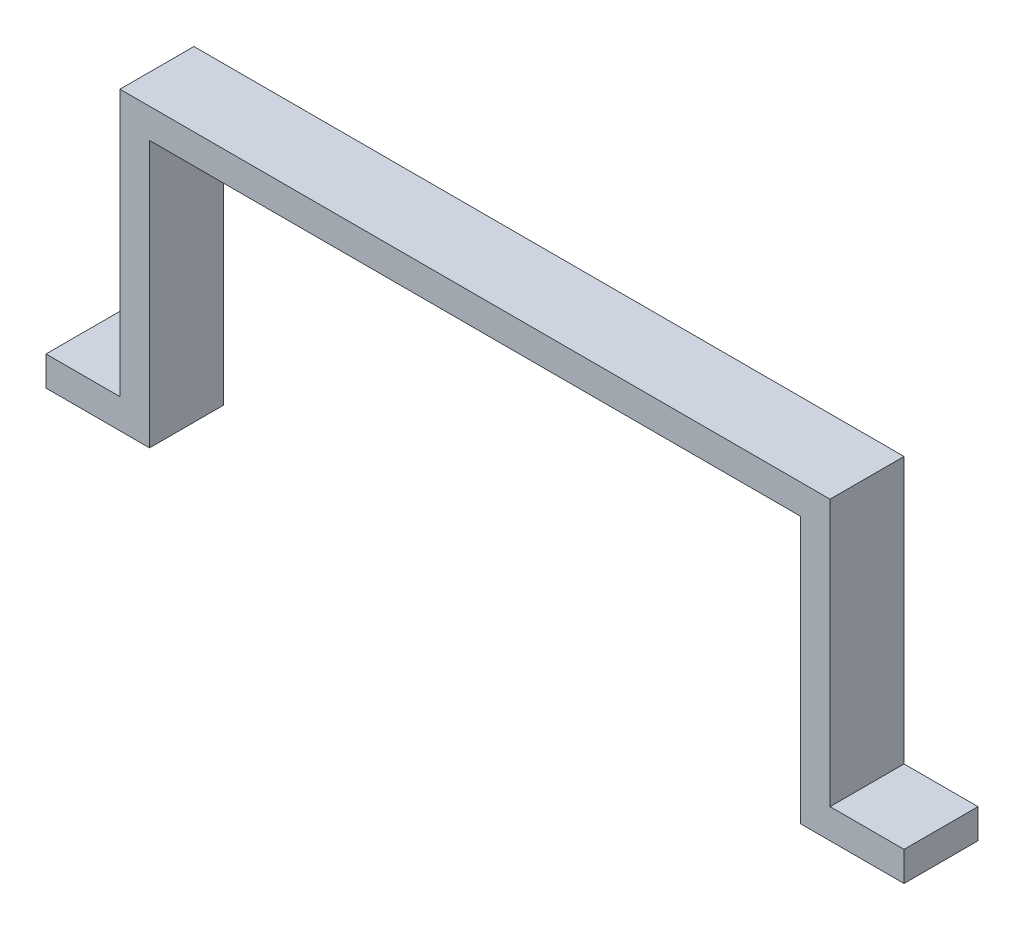
ISO-10303-21;
HEADER;
FILE_DESCRIPTION(('STEP AP214'),'2;1');
FILE_NAME('part.step','',(''),(''),'','','');
FILE_SCHEMA(('AUTOMOTIVE_DESIGN { 1 0 10303 214 1 1 1 1 }'));
ENDSEC;
DATA;
#1=APPLICATION_CONTEXT('core data for automotive mechanical design processes');
#2=APPLICATION_PROTOCOL_DEFINITION('international standard','automotive_design',2000,#1);
#3=PRODUCT_CONTEXT('',#1,'mechanical');
#4=PRODUCT('Part','Part','',(#3));
#5=PRODUCT_RELATED_PRODUCT_CATEGORY('part','',(#4));
#6=PRODUCT_DEFINITION_FORMATION('','',#4);
#7=PRODUCT_DEFINITION_CONTEXT('part definition',#1,'design');
#8=PRODUCT_DEFINITION('design','',#6,#7);
#9=PRODUCT_DEFINITION_SHAPE('','',#8);
#10=(LENGTH_UNIT() NAMED_UNIT(*) SI_UNIT(.MILLI.,.METRE.));
#11=(NAMED_UNIT(*) PLANE_ANGLE_UNIT() SI_UNIT($,.RADIAN.));
#12=(NAMED_UNIT(*) SI_UNIT($,.STERADIAN.) SOLID_ANGLE_UNIT());
#13=UNCERTAINTY_MEASURE_WITH_UNIT(LENGTH_MEASURE(1.E-05),#10,'distance_accuracy_value','');
#14=(GEOMETRIC_REPRESENTATION_CONTEXT(3) GLOBAL_UNCERTAINTY_ASSIGNED_CONTEXT((#13)) GLOBAL_UNIT_ASSIGNED_CONTEXT((#10,
#11,#12)) REPRESENTATION_CONTEXT('',''));
#15=CARTESIAN_POINT('',(0.,0.,0.));
#16=DIRECTION('',(0.,0.,1.));
#17=DIRECTION('',(1.,0.,0.));
#18=AXIS2_PLACEMENT_3D('',#15,#16,#17);
#19=CARTESIAN_POINT('',(-240.,20.,50.));
#20=DIRECTION('',(0.,-1.,0.));
#21=DIRECTION('',(1.,0.,0.));
#22=AXIS2_PLACEMENT_3D('',#19,#20,#21);
#23=PLANE('',#22);
#24=DIRECTION('',(-1.,0.,0.));
#25=VECTOR('',#24,1.);
#26=CARTESIAN_POINT('',(-240.,20.,0.));
#27=LINE('',#26,#25);
#28=CARTESIAN_POINT('',(-240.,20.,0.));
#29=VERTEX_POINT('',#28);
#30=CARTESIAN_POINT('',(-290.,20.,0.));
#31=VERTEX_POINT('',#30);
#32=EDGE_CURVE('E155',#29,#31,#27,.T.);
#33=ORIENTED_EDGE('',*,*,#32,.T.);
#34=DIRECTION('',(0.,0.,-1.));
#35=VECTOR('',#34,1.);
#36=CARTESIAN_POINT('',(-290.,20.,50.));
#37=LINE('',#36,#35);
#38=CARTESIAN_POINT('',(-290.,20.,50.));
#39=VERTEX_POINT('',#38);
#40=EDGE_CURVE('E40',#39,#31,#37,.T.);
#41=ORIENTED_EDGE('',*,*,#40,.F.);
#42=DIRECTION('',(-1.,0.,0.));
#43=VECTOR('',#42,1.);
#44=CARTESIAN_POINT('',(-240.,20.,50.));
#45=LINE('',#44,#43);
#46=CARTESIAN_POINT('',(-240.,20.,50.));
#47=VERTEX_POINT('',#46);
#48=EDGE_CURVE('E101',#47,#39,#45,.T.);
#49=ORIENTED_EDGE('',*,*,#48,.F.);
#50=DIRECTION('',(0.,0.,-1.));
#51=VECTOR('',#50,1.);
#52=CARTESIAN_POINT('',(-240.,20.,50.));
#53=LINE('',#52,#51);
#54=EDGE_CURVE('E11',#47,#29,#53,.T.);
#55=ORIENTED_EDGE('',*,*,#54,.T.);
#56=EDGE_LOOP('',(#33,#41,#49,#55));
#57=FACE_BOUND('',#56,.T.);
#58=ADVANCED_FACE('F32',(#57),#23,.F.);
#59=CARTESIAN_POINT('',(-290.,20.,50.));
#60=DIRECTION('',(1.,0.,0.));
#61=DIRECTION('',(0.,0.,-1.));
#62=AXIS2_PLACEMENT_3D('',#59,#60,#61);
#63=PLANE('',#62);
#64=DIRECTION('',(0.,-1.,0.));
#65=VECTOR('',#64,1.);
#66=CARTESIAN_POINT('',(-290.,20.,0.));
#67=LINE('',#66,#65);
#68=CARTESIAN_POINT('',(-290.,0.,0.));
#69=VERTEX_POINT('',#68);
#70=EDGE_CURVE('E157',#31,#69,#67,.T.);
#71=ORIENTED_EDGE('',*,*,#70,.T.);
#72=DIRECTION('',(0.,0.,-1.));
#73=VECTOR('',#72,1.);
#74=CARTESIAN_POINT('',(-290.,0.,50.));
#75=LINE('',#74,#73);
#76=CARTESIAN_POINT('',(-290.,0.,50.));
#77=VERTEX_POINT('',#76);
#78=EDGE_CURVE('E198',#77,#69,#75,.T.);
#79=ORIENTED_EDGE('',*,*,#78,.F.);
#80=DIRECTION('',(0.,-1.,0.));
#81=VECTOR('',#80,1.);
#82=CARTESIAN_POINT('',(-290.,20.,50.));
#83=LINE('',#82,#81);
#84=EDGE_CURVE('E206',#39,#77,#83,.T.);
#85=ORIENTED_EDGE('',*,*,#84,.F.);
#86=ORIENTED_EDGE('',*,*,#40,.T.);
#87=EDGE_LOOP('',(#71,#79,#85,#86));
#88=FACE_BOUND('',#87,.T.);
#89=ADVANCED_FACE('F204',(#88),#63,.F.);
#90=CARTESIAN_POINT('',(-290.,0.,50.));
#91=DIRECTION('',(0.,1.,0.));
#92=DIRECTION('',(-1.,0.,0.));
#93=AXIS2_PLACEMENT_3D('',#90,#91,#92);
#94=PLANE('',#93);
#95=DIRECTION('',(1.,0.,0.));
#96=VECTOR('',#95,1.);
#97=CARTESIAN_POINT('',(-290.,0.,0.));
#98=LINE('',#97,#96);
#99=CARTESIAN_POINT('',(-220.,0.,0.));
#100=VERTEX_POINT('',#99);
#101=EDGE_CURVE('E159',#69,#100,#98,.T.);
#102=ORIENTED_EDGE('',*,*,#101,.T.);
#103=DIRECTION('',(0.,0.,-1.));
#104=VECTOR('',#103,1.);
#105=CARTESIAN_POINT('',(-220.,0.,50.));
#106=LINE('',#105,#104);
#107=CARTESIAN_POINT('',(-220.,0.,50.));
#108=VERTEX_POINT('',#107);
#109=EDGE_CURVE('E195',#108,#100,#106,.T.);
#110=ORIENTED_EDGE('',*,*,#109,.F.);
#111=DIRECTION('',(1.,0.,0.));
#112=VECTOR('',#111,1.);
#113=CARTESIAN_POINT('',(-290.,0.,50.));
#114=LINE('',#113,#112);
#115=EDGE_CURVE('E218',#77,#108,#114,.T.);
#116=ORIENTED_EDGE('',*,*,#115,.F.);
#117=ORIENTED_EDGE('',*,*,#78,.T.);
#118=EDGE_LOOP('',(#102,#110,#116,#117));
#119=FACE_BOUND('',#118,.T.);
#120=ADVANCED_FACE('F215',(#119),#94,.F.);
#121=CARTESIAN_POINT('',(-220.,20.,50.));
#122=DIRECTION('',(-1.,0.,0.));
#123=DIRECTION('',(0.,0.,1.));
#124=AXIS2_PLACEMENT_3D('',#121,#122,#123);
#125=PLANE('',#124);
#126=DIRECTION('',(0.,1.,0.));
#127=VECTOR('',#126,1.);
#128=CARTESIAN_POINT('',(-220.,20.,0.));
#129=LINE('',#128,#127);
#130=CARTESIAN_POINT('',(-220.,180.,0.));
#131=VERTEX_POINT('',#130);
#132=EDGE_CURVE('E162',#100,#131,#129,.T.);
#133=ORIENTED_EDGE('',*,*,#132,.T.);
#134=DIRECTION('',(0.,0.,-1.));
#135=VECTOR('',#134,1.);
#136=CARTESIAN_POINT('',(-220.,180.,50.));
#137=LINE('',#136,#135);
#138=CARTESIAN_POINT('',(-220.,180.,50.));
#139=VERTEX_POINT('',#138);
#140=EDGE_CURVE('E192',#139,#131,#137,.T.);
#141=ORIENTED_EDGE('',*,*,#140,.F.);
#142=DIRECTION('',(0.,-1.,0.));
#143=VECTOR('',#142,1.);
#144=CARTESIAN_POINT('',(-220.,20.,50.));
#145=LINE('',#144,#143);
#146=EDGE_CURVE('E219',#139,#108,#145,.T.);
#147=ORIENTED_EDGE('',*,*,#146,.T.);
#148=ORIENTED_EDGE('',*,*,#109,.T.);
#149=EDGE_LOOP('',(#133,#141,#147,#148));
#150=FACE_BOUND('',#149,.T.);
#151=ADVANCED_FACE('F254',(#150),#125,.F.);
#152=CARTESIAN_POINT('',(-220.,180.,50.));
#153=DIRECTION('',(0.,1.,0.));
#154=DIRECTION('',(0.,0.,1.));
#155=AXIS2_PLACEMENT_3D('',#152,#153,#154);
#156=PLANE('',#155);
#157=DIRECTION('',(1.,0.,0.));
#158=VECTOR('',#157,1.);
#159=CARTESIAN_POINT('',(-220.,180.,0.));
#160=LINE('',#159,#158);
#161=CARTESIAN_POINT('',(220.,180.,0.));
#162=VERTEX_POINT('',#161);
#163=EDGE_CURVE('E164',#131,#162,#160,.T.);
#164=ORIENTED_EDGE('',*,*,#163,.T.);
#165=DIRECTION('',(0.,0.,-1.));
#166=VECTOR('',#165,1.);
#167=CARTESIAN_POINT('',(220.,180.,50.));
#168=LINE('',#167,#166);
#169=CARTESIAN_POINT('',(220.,180.,50.));
#170=VERTEX_POINT('',#169);
#171=EDGE_CURVE('E189',#170,#162,#168,.T.);
#172=ORIENTED_EDGE('',*,*,#171,.F.);
#173=DIRECTION('',(1.,0.,0.));
#174=VECTOR('',#173,1.);
#175=CARTESIAN_POINT('',(-220.,180.,50.));
#176=LINE('',#175,#174);
#177=EDGE_CURVE('E221',#139,#170,#176,.T.);
#178=ORIENTED_EDGE('',*,*,#177,.F.);
#179=ORIENTED_EDGE('',*,*,#140,.T.);
#180=EDGE_LOOP('',(#164,#172,#178,#179));
#181=FACE_BOUND('',#180,.T.);
#182=ADVANCED_FACE('F259',(#181),#156,.F.);
#183=CARTESIAN_POINT('',(220.,20.,50.));
#184=DIRECTION('',(1.,0.,0.));
#185=DIRECTION('',(0.,0.,-1.));
#186=AXIS2_PLACEMENT_3D('',#183,#184,#185);
#187=PLANE('',#186);
#188=DIRECTION('',(0.,-1.,0.));
#189=VECTOR('',#188,1.);
#190=CARTESIAN_POINT('',(220.,20.,0.));
#191=LINE('',#190,#189);
#192=CARTESIAN_POINT('',(220.,0.,0.));
#193=VERTEX_POINT('',#192);
#194=EDGE_CURVE('E167',#162,#193,#191,.T.);
#195=ORIENTED_EDGE('',*,*,#194,.T.);
#196=DIRECTION('',(0.,0.,-1.));
#197=VECTOR('',#196,1.);
#198=CARTESIAN_POINT('',(220.,0.,50.));
#199=LINE('',#198,#197);
#200=CARTESIAN_POINT('',(220.,0.,50.));
#201=VERTEX_POINT('',#200);
#202=EDGE_CURVE('E187',#201,#193,#199,.T.);
#203=ORIENTED_EDGE('',*,*,#202,.F.);
#204=DIRECTION('',(0.,1.,0.));
#205=VECTOR('',#204,1.);
#206=CARTESIAN_POINT('',(220.,20.,50.));
#207=LINE('',#206,#205);
#208=EDGE_CURVE('E227',#201,#170,#207,.T.);
#209=ORIENTED_EDGE('',*,*,#208,.T.);
#210=ORIENTED_EDGE('',*,*,#171,.T.);
#211=EDGE_LOOP('',(#195,#203,#209,#210));
#212=FACE_BOUND('',#211,.T.);
#213=ADVANCED_FACE('F263',(#212),#187,.F.);
#214=CARTESIAN_POINT('',(290.,0.,50.));
#215=DIRECTION('',(0.,-1.,0.));
#216=DIRECTION('',(1.,0.,0.));
#217=AXIS2_PLACEMENT_3D('',#214,#215,#216);
#218=PLANE('',#217);
#219=DIRECTION('',(-1.,0.,0.));
#220=VECTOR('',#219,1.);
#221=CARTESIAN_POINT('',(290.,0.,0.));
#222=LINE('',#221,#220);
#223=CARTESIAN_POINT('',(290.,0.,0.));
#224=VERTEX_POINT('',#223);
#225=EDGE_CURVE('E170',#224,#193,#222,.T.);
#226=ORIENTED_EDGE('',*,*,#225,.F.);
#227=DIRECTION('',(0.,0.,-1.));
#228=VECTOR('',#227,1.);
#229=CARTESIAN_POINT('',(290.,0.,50.));
#230=LINE('',#229,#228);
#231=CARTESIAN_POINT('',(290.,0.,50.));
#232=VERTEX_POINT('',#231);
#233=EDGE_CURVE('E185',#232,#224,#230,.T.);
#234=ORIENTED_EDGE('',*,*,#233,.F.);
#235=DIRECTION('',(-1.,0.,0.));
#236=VECTOR('',#235,1.);
#237=CARTESIAN_POINT('',(290.,0.,50.));
#238=LINE('',#237,#236);
#239=EDGE_CURVE('E230',#232,#201,#238,.T.);
#240=ORIENTED_EDGE('',*,*,#239,.T.);
#241=ORIENTED_EDGE('',*,*,#202,.T.);
#242=EDGE_LOOP('',(#226,#234,#240,#241));
#243=FACE_BOUND('',#242,.T.);
#244=ADVANCED_FACE('F267',(#243),#218,.T.);
#245=CARTESIAN_POINT('',(290.,20.,50.));
#246=DIRECTION('',(1.,0.,0.));
#247=DIRECTION('',(0.,0.,-1.));
#248=AXIS2_PLACEMENT_3D('',#245,#246,#247);
#249=PLANE('',#248);
#250=DIRECTION('',(0.,-1.,0.));
#251=VECTOR('',#250,1.);
#252=CARTESIAN_POINT('',(290.,20.,0.));
#253=LINE('',#252,#251);
#254=CARTESIAN_POINT('',(290.,20.,0.));
#255=VERTEX_POINT('',#254);
#256=EDGE_CURVE('E173',#255,#224,#253,.T.);
#257=ORIENTED_EDGE('',*,*,#256,.F.);
#258=DIRECTION('',(0.,0.,-1.));
#259=VECTOR('',#258,1.);
#260=CARTESIAN_POINT('',(290.,20.,50.));
#261=LINE('',#260,#259);
#262=CARTESIAN_POINT('',(290.,20.,50.));
#263=VERTEX_POINT('',#262);
#264=EDGE_CURVE('E138',#263,#255,#261,.T.);
#265=ORIENTED_EDGE('',*,*,#264,.F.);
#266=DIRECTION('',(0.,-1.,0.));
#267=VECTOR('',#266,1.);
#268=CARTESIAN_POINT('',(290.,20.,50.));
#269=LINE('',#268,#267);
#270=EDGE_CURVE('E146',#263,#232,#269,.T.);
#271=ORIENTED_EDGE('',*,*,#270,.T.);
#272=ORIENTED_EDGE('',*,*,#233,.T.);
#273=EDGE_LOOP('',(#257,#265,#271,#272));
#274=FACE_BOUND('',#273,.T.);
#275=ADVANCED_FACE('F234',(#274),#249,.T.);
#276=CARTESIAN_POINT('',(240.,20.,50.));
#277=DIRECTION('',(0.,1.,0.));
#278=DIRECTION('',(-1.,0.,0.));
#279=AXIS2_PLACEMENT_3D('',#276,#277,#278);
#280=PLANE('',#279);
#281=DIRECTION('',(1.,0.,0.));
#282=VECTOR('',#281,1.);
#283=CARTESIAN_POINT('',(240.,20.,0.));
#284=LINE('',#283,#282);
#285=CARTESIAN_POINT('',(240.,20.,0.));
#286=VERTEX_POINT('',#285);
#287=EDGE_CURVE('E134',#286,#255,#284,.T.);
#288=ORIENTED_EDGE('',*,*,#287,.F.);
#289=DIRECTION('',(0.,0.,-1.));
#290=VECTOR('',#289,1.);
#291=CARTESIAN_POINT('',(240.,20.,50.));
#292=LINE('',#291,#290);
#293=CARTESIAN_POINT('',(240.,20.,50.));
#294=VERTEX_POINT('',#293);
#295=EDGE_CURVE('E129',#294,#286,#292,.T.);
#296=ORIENTED_EDGE('',*,*,#295,.F.);
#297=DIRECTION('',(1.,0.,0.));
#298=VECTOR('',#297,1.);
#299=CARTESIAN_POINT('',(240.,20.,50.));
#300=LINE('',#299,#298);
#301=EDGE_CURVE('E132',#294,#263,#300,.T.);
#302=ORIENTED_EDGE('',*,*,#301,.T.);
#303=ORIENTED_EDGE('',*,*,#264,.T.);
#304=EDGE_LOOP('',(#288,#296,#302,#303));
#305=FACE_BOUND('',#304,.T.);
#306=ADVANCED_FACE('F131',(#305),#280,.T.);
#307=CARTESIAN_POINT('',(240.,200.,50.));
#308=DIRECTION('',(1.,0.,0.));
#309=DIRECTION('',(0.,1.,0.));
#310=AXIS2_PLACEMENT_3D('',#307,#308,#309);
#311=PLANE('',#310);
#312=DIRECTION('',(0.,-1.,0.));
#313=VECTOR('',#312,1.);
#314=CARTESIAN_POINT('',(240.,200.,0.));
#315=LINE('',#314,#313);
#316=CARTESIAN_POINT('',(240.,200.,0.));
#317=VERTEX_POINT('',#316);
#318=EDGE_CURVE('E177',#317,#286,#315,.T.);
#319=ORIENTED_EDGE('',*,*,#318,.F.);
#320=DIRECTION('',(0.,0.,-1.));
#321=VECTOR('',#320,1.);
#322=CARTESIAN_POINT('',(240.,200.,50.));
#323=LINE('',#322,#321);
#324=CARTESIAN_POINT('',(240.,200.,50.));
#325=VERTEX_POINT('',#324);
#326=EDGE_CURVE('E90',#325,#317,#323,.T.);
#327=ORIENTED_EDGE('',*,*,#326,.F.);
#328=DIRECTION('',(0.,-1.,0.));
#329=VECTOR('',#328,1.);
#330=CARTESIAN_POINT('',(240.,140.360024578222,50.));
#331=LINE('',#330,#329);
#332=EDGE_CURVE('E143',#325,#294,#331,.T.);
#333=ORIENTED_EDGE('',*,*,#332,.T.);
#334=ORIENTED_EDGE('',*,*,#295,.T.);
#335=EDGE_LOOP('',(#319,#327,#333,#334));
#336=FACE_BOUND('',#335,.T.);
#337=ADVANCED_FACE('F148',(#336),#311,.T.);
#338=CARTESIAN_POINT('',(240.,200.,50.));
#339=DIRECTION('',(0.,-1.,0.));
#340=DIRECTION('',(0.,0.,-1.));
#341=AXIS2_PLACEMENT_3D('',#338,#339,#340);
#342=PLANE('',#341);
#343=DIRECTION('',(-1.,0.,0.));
#344=VECTOR('',#343,1.);
#345=CARTESIAN_POINT('',(240.,200.,0.));
#346=LINE('',#345,#344);
#347=CARTESIAN_POINT('',(-240.,200.,0.));
#348=VERTEX_POINT('',#347);
#349=EDGE_CURVE('E94',#317,#348,#346,.T.);
#350=ORIENTED_EDGE('',*,*,#349,.T.);
#351=DIRECTION('',(0.,0.,-1.));
#352=VECTOR('',#351,1.);
#353=CARTESIAN_POINT('',(-240.,200.,50.));
#354=LINE('',#353,#352);
#355=CARTESIAN_POINT('',(-240.,200.,50.));
#356=VERTEX_POINT('',#355);
#357=EDGE_CURVE('E151',#356,#348,#354,.T.);
#358=ORIENTED_EDGE('',*,*,#357,.F.);
#359=DIRECTION('',(-1.,0.,0.));
#360=VECTOR('',#359,1.);
#361=CARTESIAN_POINT('',(240.,200.,50.));
#362=LINE('',#361,#360);
#363=EDGE_CURVE('E149',#325,#356,#362,.T.);
#364=ORIENTED_EDGE('',*,*,#363,.F.);
#365=ORIENTED_EDGE('',*,*,#326,.T.);
#366=EDGE_LOOP('',(#350,#358,#364,#365));
#367=FACE_BOUND('',#366,.T.);
#368=ADVANCED_FACE('F237',(#367),#342,.F.);
#369=CARTESIAN_POINT('',(-240.,200.,50.));
#370=DIRECTION('',(1.,0.,0.));
#371=DIRECTION('',(0.,1.,0.));
#372=AXIS2_PLACEMENT_3D('',#369,#370,#371);
#373=PLANE('',#372);
#374=DIRECTION('',(0.,-1.,0.));
#375=VECTOR('',#374,1.);
#376=CARTESIAN_POINT('',(-240.,200.,0.));
#377=LINE('',#376,#375);
#378=EDGE_CURVE('E180',#348,#29,#377,.T.);
#379=ORIENTED_EDGE('',*,*,#378,.T.);
#380=ORIENTED_EDGE('',*,*,#54,.F.);
#381=DIRECTION('',(0.,-1.,0.));
#382=VECTOR('',#381,1.);
#383=CARTESIAN_POINT('',(-240.,140.360024578222,50.));
#384=LINE('',#383,#382);
#385=EDGE_CURVE('E48',#356,#47,#384,.T.);
#386=ORIENTED_EDGE('',*,*,#385,.F.);
#387=ORIENTED_EDGE('',*,*,#357,.T.);
#388=EDGE_LOOP('',(#379,#380,#386,#387));
#389=FACE_BOUND('',#388,.T.);
#390=ADVANCED_FACE('F236',(#389),#373,.F.);
#391=CARTESIAN_POINT('',(0.,0.,50.));
#392=DIRECTION('',(0.,0.,-1.));
#393=DIRECTION('',(-1.,0.,0.));
#394=AXIS2_PLACEMENT_3D('',#391,#392,#393);
#395=PLANE('',#394);
#396=ORIENTED_EDGE('',*,*,#385,.T.);
#397=ORIENTED_EDGE('',*,*,#48,.T.);
#398=ORIENTED_EDGE('',*,*,#84,.T.);
#399=ORIENTED_EDGE('',*,*,#115,.T.);
#400=ORIENTED_EDGE('',*,*,#146,.F.);
#401=ORIENTED_EDGE('',*,*,#177,.T.);
#402=ORIENTED_EDGE('',*,*,#208,.F.);
#403=ORIENTED_EDGE('',*,*,#239,.F.);
#404=ORIENTED_EDGE('',*,*,#270,.F.);
#405=ORIENTED_EDGE('',*,*,#301,.F.);
#406=ORIENTED_EDGE('',*,*,#332,.F.);
#407=ORIENTED_EDGE('',*,*,#363,.T.);
#408=EDGE_LOOP('',(#396,#397,#398,#399,#400,#401,#402,#403,#404,#405,#406,#407));
#409=FACE_BOUND('',#408,.T.);
#410=ADVANCED_FACE('F142',(#409),#395,.F.);
#411=CARTESIAN_POINT('',(0.,0.,0.));
#412=DIRECTION('',(0.,0.,-1.));
#413=DIRECTION('',(-1.,0.,0.));
#414=AXIS2_PLACEMENT_3D('',#411,#412,#413);
#415=PLANE('',#414);
#416=ORIENTED_EDGE('',*,*,#32,.F.);
#417=ORIENTED_EDGE('',*,*,#378,.F.);
#418=ORIENTED_EDGE('',*,*,#349,.F.);
#419=ORIENTED_EDGE('',*,*,#318,.T.);
#420=ORIENTED_EDGE('',*,*,#287,.T.);
#421=ORIENTED_EDGE('',*,*,#256,.T.);
#422=ORIENTED_EDGE('',*,*,#225,.T.);
#423=ORIENTED_EDGE('',*,*,#194,.F.);
#424=ORIENTED_EDGE('',*,*,#163,.F.);
#425=ORIENTED_EDGE('',*,*,#132,.F.);
#426=ORIENTED_EDGE('',*,*,#101,.F.);
#427=ORIENTED_EDGE('',*,*,#70,.F.);
#428=EDGE_LOOP('',(#416,#417,#418,#419,#420,#421,#422,#423,#424,#425,#426,#427));
#429=FACE_BOUND('',#428,.T.);
#430=ADVANCED_FACE('F210',(#429),#415,.T.);
#431=CLOSED_SHELL('',(#58,#89,#120,#151,#182,#213,#244,#275,#306,#337,#368,#390,#410,#430));
#432=MANIFOLD_SOLID_BREP('B2',#431);
#433=ADVANCED_BREP_SHAPE_REPRESENTATION('',(#18,#432),#14);
#434=SHAPE_DEFINITION_REPRESENTATION(#9,#433);
ENDSEC;
END-ISO-10303-21;
